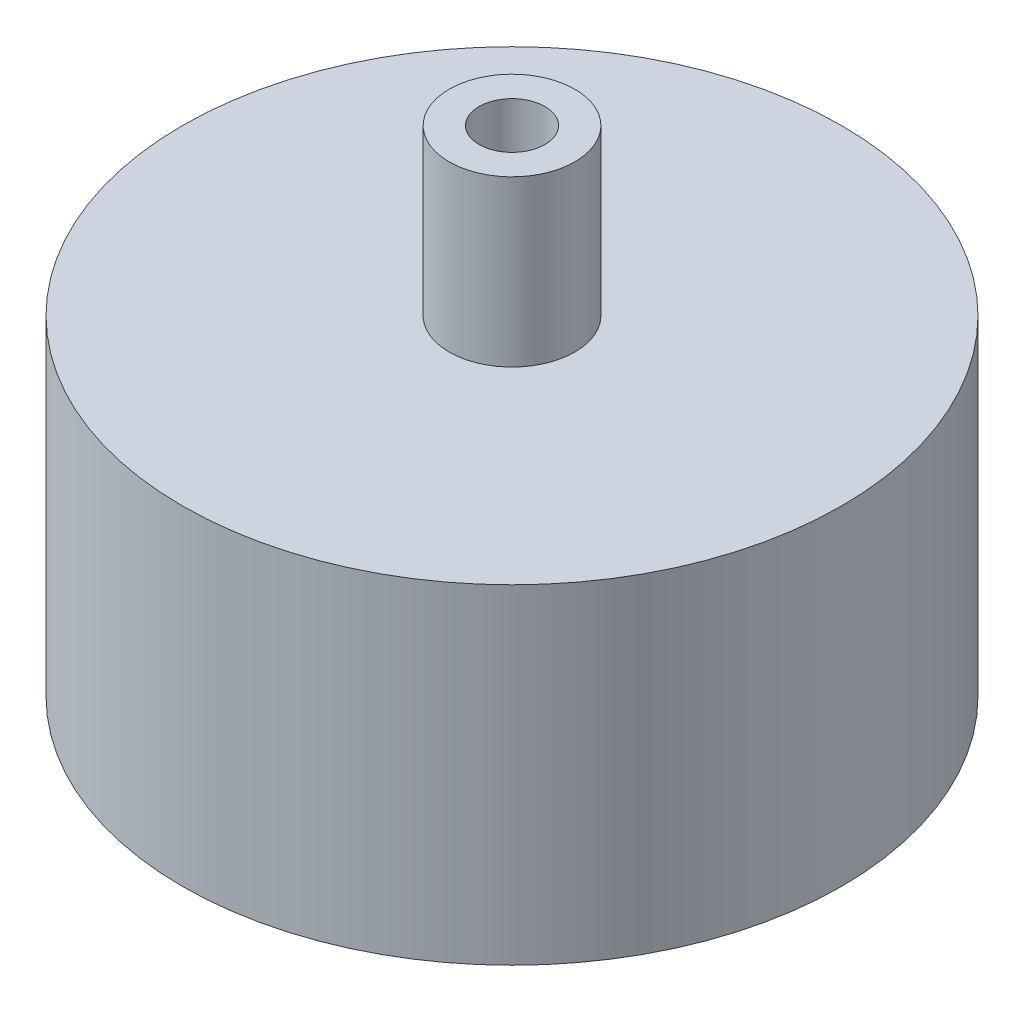
ISO-10303-21;
HEADER;
FILE_DESCRIPTION(('STEP AP214'),'2;1');
FILE_NAME('part.step','',(''),(''),'','','');
FILE_SCHEMA(('AUTOMOTIVE_DESIGN { 1 0 10303 214 1 1 1 1 }'));
ENDSEC;
DATA;
#1=APPLICATION_CONTEXT('core data for automotive mechanical design processes');
#2=APPLICATION_PROTOCOL_DEFINITION('international standard','automotive_design',2000,#1);
#3=PRODUCT_CONTEXT('',#1,'mechanical');
#4=PRODUCT('Part','Part','',(#3));
#5=PRODUCT_RELATED_PRODUCT_CATEGORY('part','',(#4));
#6=PRODUCT_DEFINITION_FORMATION('','',#4);
#7=PRODUCT_DEFINITION_CONTEXT('part definition',#1,'design');
#8=PRODUCT_DEFINITION('design','',#6,#7);
#9=PRODUCT_DEFINITION_SHAPE('','',#8);
#10=(LENGTH_UNIT() NAMED_UNIT(*) SI_UNIT(.MILLI.,.METRE.));
#11=(NAMED_UNIT(*) PLANE_ANGLE_UNIT() SI_UNIT($,.RADIAN.));
#12=(NAMED_UNIT(*) SI_UNIT($,.STERADIAN.) SOLID_ANGLE_UNIT());
#13=UNCERTAINTY_MEASURE_WITH_UNIT(LENGTH_MEASURE(1.E-05),#10,'distance_accuracy_value','');
#14=(GEOMETRIC_REPRESENTATION_CONTEXT(3) GLOBAL_UNCERTAINTY_ASSIGNED_CONTEXT((#13)) GLOBAL_UNIT_ASSIGNED_CONTEXT((#10,
#11,#12)) REPRESENTATION_CONTEXT('',''));
#15=CARTESIAN_POINT('',(0.,0.,0.));
#16=DIRECTION('',(0.,0.,1.));
#17=DIRECTION('',(1.,0.,0.));
#18=AXIS2_PLACEMENT_3D('',#15,#16,#17);
#19=CARTESIAN_POINT('',(0.,30.,0.));
#20=DIRECTION('',(0.,-1.,0.));
#21=DIRECTION('',(0.,0.,-1.));
#22=AXIS2_PLACEMENT_3D('',#19,#20,#21);
#23=CYLINDRICAL_SURFACE('',#22,30.);
#24=CARTESIAN_POINT('',(0.,30.,0.));
#25=DIRECTION('',(0.,1.,0.));
#26=DIRECTION('',(0.,0.,1.));
#27=AXIS2_PLACEMENT_3D('',#24,#25,#26);
#28=CIRCLE('',#27,30.);
#29=CARTESIAN_POINT('',(0.,30.,30.));
#30=VERTEX_POINT('',#29);
#31=EDGE_CURVE('E39',#30,#30,#28,.T.);
#32=ORIENTED_EDGE('',*,*,#31,.F.);
#33=EDGE_LOOP('',(#32));
#34=FACE_BOUND('',#33,.T.);
#35=CARTESIAN_POINT('',(0.,0.,0.));
#36=DIRECTION('',(0.,1.,0.));
#37=DIRECTION('',(0.,0.,1.));
#38=AXIS2_PLACEMENT_3D('',#35,#36,#37);
#39=CIRCLE('',#38,30.);
#40=CARTESIAN_POINT('',(0.,0.,30.));
#41=VERTEX_POINT('',#40);
#42=EDGE_CURVE('E43',#41,#41,#39,.T.);
#43=ORIENTED_EDGE('',*,*,#42,.T.);
#44=EDGE_LOOP('',(#43));
#45=FACE_BOUND('',#44,.T.);
#46=ADVANCED_FACE('F33',(#34,#45),#23,.T.);
#47=CARTESIAN_POINT('',(0.,30.,0.));
#48=DIRECTION('',(0.,1.,0.));
#49=DIRECTION('',(0.,0.,1.));
#50=AXIS2_PLACEMENT_3D('',#47,#48,#49);
#51=PLANE('',#50);
#52=CARTESIAN_POINT('',(0.,30.,0.));
#53=DIRECTION('',(0.,1.,0.));
#54=DIRECTION('',(0.,0.,1.));
#55=AXIS2_PLACEMENT_3D('',#52,#53,#54);
#56=CIRCLE('',#55,5.725);
#57=CARTESIAN_POINT('',(0.,30.,5.725));
#58=VERTEX_POINT('',#57);
#59=EDGE_CURVE('E50',#58,#58,#56,.T.);
#60=ORIENTED_EDGE('',*,*,#59,.F.);
#61=EDGE_LOOP('',(#60));
#62=FACE_BOUND('',#61,.T.);
#63=ORIENTED_EDGE('',*,*,#31,.T.);
#64=EDGE_LOOP('',(#63));
#65=FACE_BOUND('',#64,.T.);
#66=ADVANCED_FACE('F73',(#62,#65),#51,.T.);
#67=CARTESIAN_POINT('',(0.,0.,0.));
#68=DIRECTION('',(0.,1.,0.));
#69=DIRECTION('',(0.,0.,1.));
#70=AXIS2_PLACEMENT_3D('',#67,#68,#69);
#71=PLANE('',#70);
#72=ORIENTED_EDGE('',*,*,#42,.F.);
#73=EDGE_LOOP('',(#72));
#74=FACE_BOUND('',#73,.T.);
#75=ADVANCED_FACE('F64',(#74),#71,.F.);
#76=CARTESIAN_POINT('',(0.,45.,0.));
#77=DIRECTION('',(0.,1.,0.));
#78=DIRECTION('',(0.,0.,1.));
#79=AXIS2_PLACEMENT_3D('',#76,#77,#78);
#80=PLANE('',#79);
#81=CARTESIAN_POINT('',(0.,45.,0.));
#82=DIRECTION('',(0.,1.,0.));
#83=DIRECTION('',(0.,0.,1.));
#84=AXIS2_PLACEMENT_3D('',#81,#82,#83);
#85=CIRCLE('',#84,5.725);
#86=CARTESIAN_POINT('',(0.,45.,5.725));
#87=VERTEX_POINT('',#86);
#88=EDGE_CURVE('E48',#87,#87,#85,.T.);
#89=ORIENTED_EDGE('',*,*,#88,.T.);
#90=EDGE_LOOP('',(#89));
#91=FACE_BOUND('',#90,.T.);
#92=CARTESIAN_POINT('',(0.,45.,0.));
#93=DIRECTION('',(0.,1.,0.));
#94=DIRECTION('',(0.,0.,1.));
#95=AXIS2_PLACEMENT_3D('',#92,#93,#94);
#96=CIRCLE('',#95,3.);
#97=CARTESIAN_POINT('',(0.,45.,3.));
#98=VERTEX_POINT('',#97);
#99=EDGE_CURVE('E53',#98,#98,#96,.T.);
#100=ORIENTED_EDGE('',*,*,#99,.F.);
#101=EDGE_LOOP('',(#100));
#102=FACE_BOUND('',#101,.T.);
#103=ADVANCED_FACE('F61',(#91,#102),#80,.T.);
#104=CARTESIAN_POINT('',(0.,45.,0.));
#105=DIRECTION('',(0.,-1.,0.));
#106=DIRECTION('',(0.,0.,-1.));
#107=AXIS2_PLACEMENT_3D('',#104,#105,#106);
#108=CYLINDRICAL_SURFACE('',#107,5.725);
#109=ORIENTED_EDGE('',*,*,#88,.F.);
#110=EDGE_LOOP('',(#109));
#111=FACE_BOUND('',#110,.T.);
#112=ORIENTED_EDGE('',*,*,#59,.T.);
#113=EDGE_LOOP('',(#112));
#114=FACE_BOUND('',#113,.T.);
#115=ADVANCED_FACE('F63',(#111,#114),#108,.T.);
#116=CARTESIAN_POINT('',(0.,45.,0.));
#117=DIRECTION('',(0.,-1.,0.));
#118=DIRECTION('',(0.,0.,-1.));
#119=AXIS2_PLACEMENT_3D('',#116,#117,#118);
#120=CYLINDRICAL_SURFACE('',#119,3.);
#121=ORIENTED_EDGE('',*,*,#99,.T.);
#122=EDGE_LOOP('',(#121));
#123=FACE_BOUND('',#122,.T.);
#124=CARTESIAN_POINT('',(0.,30.,0.));
#125=DIRECTION('',(0.,1.,0.));
#126=DIRECTION('',(0.,0.,1.));
#127=AXIS2_PLACEMENT_3D('',#124,#125,#126);
#128=CIRCLE('',#127,3.);
#129=CARTESIAN_POINT('',(0.,30.,3.));
#130=VERTEX_POINT('',#129);
#131=EDGE_CURVE('E10',#130,#130,#128,.F.);
#132=ORIENTED_EDGE('',*,*,#131,.T.);
#133=EDGE_LOOP('',(#132));
#134=FACE_BOUND('',#133,.T.);
#135=ADVANCED_FACE('F59',(#123,#134),#120,.F.);
#136=ORIENTED_EDGE('',*,*,#131,.F.);
#137=EDGE_LOOP('',(#136));
#138=FACE_BOUND('',#137,.T.);
#139=ADVANCED_FACE('F83',(#138),#51,.T.);
#140=CLOSED_SHELL('',(#46,#66,#75,#103,#115,#135,#139));
#141=MANIFOLD_SOLID_BREP('B2',#140);
#142=ADVANCED_BREP_SHAPE_REPRESENTATION('',(#18,#141),#14);
#143=SHAPE_DEFINITION_REPRESENTATION(#9,#142);
ENDSEC;
END-ISO-10303-21;
